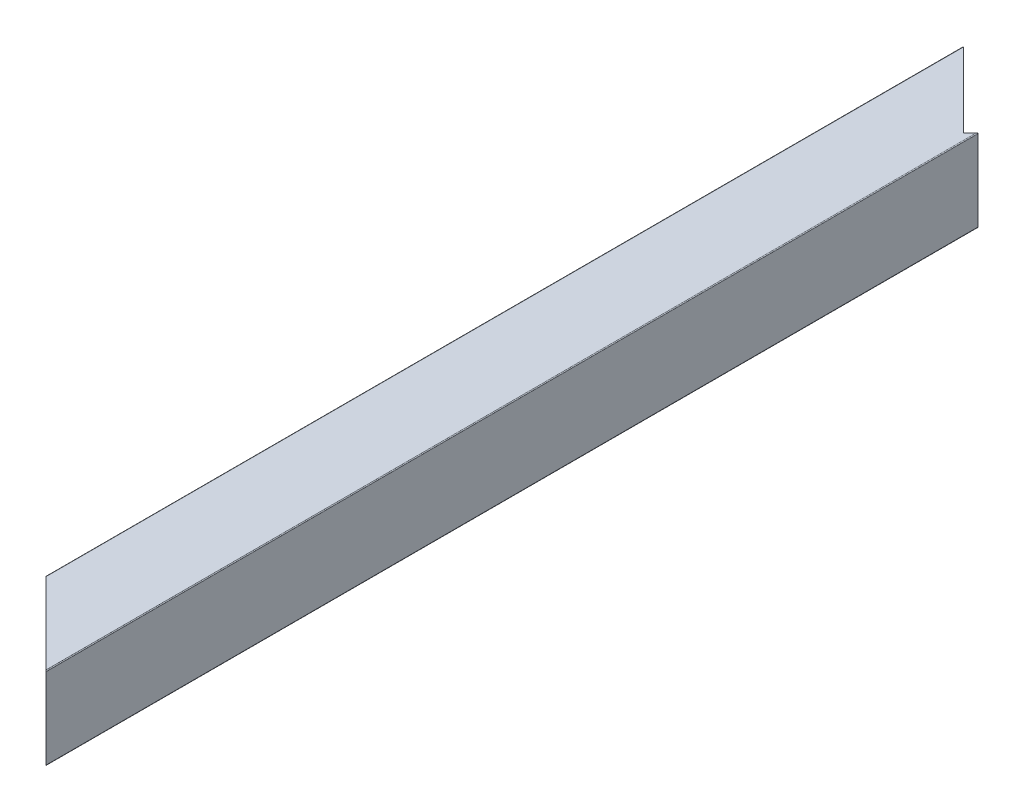
ISO-10303-21;
HEADER;
FILE_DESCRIPTION(('STEP AP214'),'2;1');
FILE_NAME('part.step','',(''),(''),'','','');
FILE_SCHEMA(('AUTOMOTIVE_DESIGN { 1 0 10303 214 1 1 1 1 }'));
ENDSEC;
DATA;
#1=APPLICATION_CONTEXT('core data for automotive mechanical design processes');
#2=APPLICATION_PROTOCOL_DEFINITION('international standard','automotive_design',2000,#1);
#3=PRODUCT_CONTEXT('',#1,'mechanical');
#4=PRODUCT('Part','Part','',(#3));
#5=PRODUCT_RELATED_PRODUCT_CATEGORY('part','',(#4));
#6=PRODUCT_DEFINITION_FORMATION('','',#4);
#7=PRODUCT_DEFINITION_CONTEXT('part definition',#1,'design');
#8=PRODUCT_DEFINITION('design','',#6,#7);
#9=PRODUCT_DEFINITION_SHAPE('','',#8);
#10=(LENGTH_UNIT() NAMED_UNIT(*) SI_UNIT(.MILLI.,.METRE.));
#11=(NAMED_UNIT(*) PLANE_ANGLE_UNIT() SI_UNIT($,.RADIAN.));
#12=(NAMED_UNIT(*) SI_UNIT($,.STERADIAN.) SOLID_ANGLE_UNIT());
#13=UNCERTAINTY_MEASURE_WITH_UNIT(LENGTH_MEASURE(1.E-05),#10,'distance_accuracy_value','');
#14=(GEOMETRIC_REPRESENTATION_CONTEXT(3) GLOBAL_UNCERTAINTY_ASSIGNED_CONTEXT((#13)) GLOBAL_UNIT_ASSIGNED_CONTEXT((#10,
#11,#12)) REPRESENTATION_CONTEXT('',''));
#15=CARTESIAN_POINT('',(0.,0.,0.));
#16=DIRECTION('',(0.,0.,1.));
#17=DIRECTION('',(1.,0.,0.));
#18=AXIS2_PLACEMENT_3D('',#15,#16,#17);
#19=CARTESIAN_POINT('',(3.175,4.7625,1828.8));
#20=DIRECTION('',(1.,0.,0.));
#21=DIRECTION('',(0.,1.,0.));
#22=AXIS2_PLACEMENT_3D('',#19,#20,#21);
#23=PLANE('',#22);
#24=DIRECTION('',(0.,1.,0.));
#25=VECTOR('',#24,1.);
#26=CARTESIAN_POINT('',(3.175,4.7625,1806.575));
#27=LINE('',#26,#25);
#28=CARTESIAN_POINT('',(3.175,4.7625,1806.575));
#29=VERTEX_POINT('',#28);
#30=CARTESIAN_POINT('',(3.175,20.6375,1806.575));
#31=VERTEX_POINT('',#30);
#32=EDGE_CURVE('E340',#29,#31,#27,.T.);
#33=ORIENTED_EDGE('',*,*,#32,.F.);
#34=DIRECTION('',(0.,0.,-1.));
#35=VECTOR('',#34,1.);
#36=CARTESIAN_POINT('',(3.175,4.7625,1828.8));
#37=LINE('',#36,#35);
#38=CARTESIAN_POINT('',(3.175,4.7625,1523.619));
#39=VERTEX_POINT('',#38);
#40=EDGE_CURVE('E69',#29,#39,#37,.T.);
#41=ORIENTED_EDGE('',*,*,#40,.T.);
#42=DIRECTION('',(0.,-1.,0.));
#43=VECTOR('',#42,1.);
#44=CARTESIAN_POINT('',(3.175,4.7625,1523.619));
#45=LINE('',#44,#43);
#46=CARTESIAN_POINT('',(3.175,20.6375,1523.619));
#47=VERTEX_POINT('',#46);
#48=EDGE_CURVE('E289',#47,#39,#45,.T.);
#49=ORIENTED_EDGE('',*,*,#48,.F.);
#50=DIRECTION('',(0.,0.,-1.));
#51=VECTOR('',#50,1.);
#52=CARTESIAN_POINT('',(3.175,20.6375,1828.8));
#53=LINE('',#52,#51);
#54=EDGE_CURVE('E11',#31,#47,#53,.T.);
#55=ORIENTED_EDGE('',*,*,#54,.F.);
#56=EDGE_LOOP('',(#33,#41,#49,#55));
#57=FACE_BOUND('',#56,.T.);
#58=ADVANCED_FACE('F43',(#57),#23,.T.);
#59=CARTESIAN_POINT('',(4.7625,20.6375,1828.8));
#60=DIRECTION('',(0.,0.,-1.));
#61=DIRECTION('',(-1.,0.,0.));
#62=AXIS2_PLACEMENT_3D('',#59,#60,#61);
#63=CYLINDRICAL_SURFACE('',#62,1.5875);
#64=DIRECTION('',(0.,0.,-1.));
#65=VECTOR('',#64,1.);
#66=CARTESIAN_POINT('',(4.7625,22.225,1828.8));
#67=LINE('',#66,#65);
#68=CARTESIAN_POINT('',(4.7625,22.225,1808.1625));
#69=VERTEX_POINT('',#68);
#70=CARTESIAN_POINT('',(4.7625,22.225,1525.2065));
#71=VERTEX_POINT('',#70);
#72=EDGE_CURVE('E53',#69,#71,#67,.T.);
#73=ORIENTED_EDGE('',*,*,#72,.F.);
#74=CARTESIAN_POINT('',(4.7625,20.6375,1808.1625));
#75=DIRECTION('',(0.707106781186545,0.,-0.70710678118655));
#76=DIRECTION('',(-0.70710678118655,0.,-0.707106781186545));
#77=AXIS2_PLACEMENT_3D('',#74,#75,#76);
#78=ELLIPSE('',#77,2.24506403026728,1.5875);
#79=EDGE_CURVE('E333',#69,#31,#78,.F.);
#80=ORIENTED_EDGE('',*,*,#79,.T.);
#81=ORIENTED_EDGE('',*,*,#54,.T.);
#82=CARTESIAN_POINT('',(4.7625,20.6375,1525.2065));
#83=DIRECTION('',(-0.707106781186546,0.,0.707106781186549));
#84=DIRECTION('',(-0.707106781186549,0.,-0.707106781186546));
#85=AXIS2_PLACEMENT_3D('',#82,#83,#84);
#86=ELLIPSE('',#85,2.24506403026728,1.5875);
#87=EDGE_CURVE('E282',#47,#71,#86,.F.);
#88=ORIENTED_EDGE('',*,*,#87,.T.);
#89=EDGE_LOOP('',(#73,#80,#81,#88));
#90=FACE_BOUND('',#89,.T.);
#91=ADVANCED_FACE('F287',(#90),#63,.F.);
#92=CARTESIAN_POINT('',(4.7625,22.225,1828.8));
#93=DIRECTION('',(0.,-1.,0.));
#94=DIRECTION('',(0.,0.,-1.));
#95=AXIS2_PLACEMENT_3D('',#92,#93,#94);
#96=PLANE('',#95);
#97=DIRECTION('',(0.70710678118655,0.,0.707106781186545));
#98=VECTOR('',#97,1.);
#99=CARTESIAN_POINT('',(15.08125,22.225,1818.48125));
#100=LINE('',#99,#98);
#101=CARTESIAN_POINT('',(20.6375,22.225,1824.0375));
#102=VERTEX_POINT('',#101);
#103=EDGE_CURVE('E273',#69,#102,#100,.T.);
#104=ORIENTED_EDGE('',*,*,#103,.F.);
#105=ORIENTED_EDGE('',*,*,#72,.T.);
#106=DIRECTION('',(-0.707106781186549,0.,-0.707106781186546));
#107=VECTOR('',#106,1.);
#108=CARTESIAN_POINT('',(156.55925,22.225,1677.00325));
#109=LINE('',#108,#107);
#110=CARTESIAN_POINT('',(20.6375,22.225,1541.0815));
#111=VERTEX_POINT('',#110);
#112=EDGE_CURVE('E272',#111,#71,#109,.T.);
#113=ORIENTED_EDGE('',*,*,#112,.F.);
#114=DIRECTION('',(0.,0.,-1.));
#115=VECTOR('',#114,1.);
#116=CARTESIAN_POINT('',(20.6375,22.225,1828.8));
#117=LINE('',#116,#115);
#118=EDGE_CURVE('E259',#102,#111,#117,.T.);
#119=ORIENTED_EDGE('',*,*,#118,.F.);
#120=EDGE_LOOP('',(#104,#105,#113,#119));
#121=FACE_BOUND('',#120,.T.);
#122=ADVANCED_FACE('F270',(#121),#96,.T.);
#123=CARTESIAN_POINT('',(20.6375,20.6375,1828.8));
#124=DIRECTION('',(0.,0.,-1.));
#125=DIRECTION('',(-1.,0.,0.));
#126=AXIS2_PLACEMENT_3D('',#123,#124,#125);
#127=CYLINDRICAL_SURFACE('',#126,1.5875);
#128=DIRECTION('',(0.,0.,-1.));
#129=VECTOR('',#128,1.);
#130=CARTESIAN_POINT('',(22.225,20.6375,1828.8));
#131=LINE('',#130,#129);
#132=CARTESIAN_POINT('',(22.225,20.6375,1825.625));
#133=VERTEX_POINT('',#132);
#134=CARTESIAN_POINT('',(22.225,20.6375,1542.669));
#135=VERTEX_POINT('',#134);
#136=EDGE_CURVE('E205',#133,#135,#131,.T.);
#137=ORIENTED_EDGE('',*,*,#136,.F.);
#138=CARTESIAN_POINT('',(20.6375,20.6375,1824.0375));
#139=DIRECTION('',(0.707106781186545,0.,-0.70710678118655));
#140=DIRECTION('',(-0.70710678118655,0.,-0.707106781186545));
#141=AXIS2_PLACEMENT_3D('',#138,#139,#140);
#142=ELLIPSE('',#141,2.24506403026728,1.5875);
#143=EDGE_CURVE('E329',#133,#102,#142,.F.);
#144=ORIENTED_EDGE('',*,*,#143,.T.);
#145=ORIENTED_EDGE('',*,*,#118,.T.);
#146=CARTESIAN_POINT('',(20.6375,20.6375,1541.0815));
#147=DIRECTION('',(-0.707106781186546,0.,0.707106781186549));
#148=DIRECTION('',(-0.707106781186549,0.,-0.707106781186546));
#149=AXIS2_PLACEMENT_3D('',#146,#147,#148);
#150=ELLIPSE('',#149,2.24506403026728,1.5875);
#151=EDGE_CURVE('E285',#111,#135,#150,.F.);
#152=ORIENTED_EDGE('',*,*,#151,.T.);
#153=EDGE_LOOP('',(#137,#144,#145,#152));
#154=FACE_BOUND('',#153,.T.);
#155=ADVANCED_FACE('F327',(#154),#127,.F.);
#156=CARTESIAN_POINT('',(22.225,4.7625,1828.8));
#157=DIRECTION('',(-1.,0.,0.));
#158=DIRECTION('',(0.,0.,1.));
#159=AXIS2_PLACEMENT_3D('',#156,#157,#158);
#160=PLANE('',#159);
#161=DIRECTION('',(0.,-1.,0.));
#162=VECTOR('',#161,1.);
#163=CARTESIAN_POINT('',(22.225,4.7625,1825.625));
#164=LINE('',#163,#162);
#165=CARTESIAN_POINT('',(22.225,4.7625,1825.625));
#166=VERTEX_POINT('',#165);
#167=EDGE_CURVE('E331',#133,#166,#164,.T.);
#168=ORIENTED_EDGE('',*,*,#167,.F.);
#169=ORIENTED_EDGE('',*,*,#136,.T.);
#170=DIRECTION('',(0.,1.,0.));
#171=VECTOR('',#170,1.);
#172=CARTESIAN_POINT('',(22.225,4.7625,1542.669));
#173=LINE('',#172,#171);
#174=CARTESIAN_POINT('',(22.225,4.7625,1542.669));
#175=VERTEX_POINT('',#174);
#176=EDGE_CURVE('E324',#175,#135,#173,.T.);
#177=ORIENTED_EDGE('',*,*,#176,.F.);
#178=DIRECTION('',(0.,0.,-1.));
#179=VECTOR('',#178,1.);
#180=CARTESIAN_POINT('',(22.225,4.7625,1828.8));
#181=LINE('',#180,#179);
#182=EDGE_CURVE('E216',#166,#175,#181,.T.);
#183=ORIENTED_EDGE('',*,*,#182,.F.);
#184=EDGE_LOOP('',(#168,#169,#177,#183));
#185=FACE_BOUND('',#184,.T.);
#186=ADVANCED_FACE('F391',(#185),#160,.T.);
#187=CARTESIAN_POINT('',(20.6375,4.7625,1828.8));
#188=DIRECTION('',(0.,0.,-1.));
#189=DIRECTION('',(-1.,0.,0.));
#190=AXIS2_PLACEMENT_3D('',#187,#188,#189);
#191=CYLINDRICAL_SURFACE('',#190,1.5875);
#192=DIRECTION('',(0.,0.,-1.));
#193=VECTOR('',#192,1.);
#194=CARTESIAN_POINT('',(20.6375,3.175,1828.8));
#195=LINE('',#194,#193);
#196=CARTESIAN_POINT('',(20.6375,3.175,1824.0375));
#197=VERTEX_POINT('',#196);
#198=CARTESIAN_POINT('',(20.6375,3.175,1541.0815));
#199=VERTEX_POINT('',#198);
#200=EDGE_CURVE('E214',#197,#199,#195,.T.);
#201=ORIENTED_EDGE('',*,*,#200,.F.);
#202=CARTESIAN_POINT('',(20.6375,4.7625,1824.0375));
#203=DIRECTION('',(0.707106781186545,0.,-0.70710678118655));
#204=DIRECTION('',(-0.70710678118655,0.,-0.707106781186545));
#205=AXIS2_PLACEMENT_3D('',#202,#203,#204);
#206=ELLIPSE('',#205,2.24506403026728,1.5875);
#207=EDGE_CURVE('E335',#197,#166,#206,.F.);
#208=ORIENTED_EDGE('',*,*,#207,.T.);
#209=ORIENTED_EDGE('',*,*,#182,.T.);
#210=CARTESIAN_POINT('',(20.6375,4.7625,1541.0815));
#211=DIRECTION('',(-0.707106781186546,0.,0.707106781186549));
#212=DIRECTION('',(-0.707106781186549,0.,-0.707106781186546));
#213=AXIS2_PLACEMENT_3D('',#210,#211,#212);
#214=ELLIPSE('',#213,2.24506403026728,1.5875);
#215=EDGE_CURVE('E321',#175,#199,#214,.F.);
#216=ORIENTED_EDGE('',*,*,#215,.T.);
#217=EDGE_LOOP('',(#201,#208,#209,#216));
#218=FACE_BOUND('',#217,.T.);
#219=ADVANCED_FACE('F388',(#218),#191,.F.);
#220=CARTESIAN_POINT('',(4.7625,3.175,1828.8));
#221=DIRECTION('',(0.,1.,0.));
#222=DIRECTION('',(1.,0.,0.));
#223=AXIS2_PLACEMENT_3D('',#220,#221,#222);
#224=PLANE('',#223);
#225=DIRECTION('',(-0.70710678118655,0.,-0.707106781186545));
#226=VECTOR('',#225,1.);
#227=CARTESIAN_POINT('',(15.08125,3.175,1818.48125));
#228=LINE('',#227,#226);
#229=CARTESIAN_POINT('',(4.7625,3.175,1808.1625));
#230=VERTEX_POINT('',#229);
#231=EDGE_CURVE('E61',#197,#230,#228,.T.);
#232=ORIENTED_EDGE('',*,*,#231,.F.);
#233=ORIENTED_EDGE('',*,*,#200,.T.);
#234=DIRECTION('',(0.707106781186549,0.,0.707106781186546));
#235=VECTOR('',#234,1.);
#236=CARTESIAN_POINT('',(156.55925,3.175,1677.00325));
#237=LINE('',#236,#235);
#238=CARTESIAN_POINT('',(4.7625,3.175,1525.2065));
#239=VERTEX_POINT('',#238);
#240=EDGE_CURVE('E314',#239,#199,#237,.T.);
#241=ORIENTED_EDGE('',*,*,#240,.F.);
#242=DIRECTION('',(0.,0.,-1.));
#243=VECTOR('',#242,1.);
#244=CARTESIAN_POINT('',(4.7625,3.175,1828.8));
#245=LINE('',#244,#243);
#246=EDGE_CURVE('E217',#230,#239,#245,.T.);
#247=ORIENTED_EDGE('',*,*,#246,.F.);
#248=EDGE_LOOP('',(#232,#233,#241,#247));
#249=FACE_BOUND('',#248,.T.);
#250=ADVANCED_FACE('F390',(#249),#224,.T.);
#251=CARTESIAN_POINT('',(4.7625,4.7625,1828.8));
#252=DIRECTION('',(0.,0.,-1.));
#253=DIRECTION('',(-1.,0.,0.));
#254=AXIS2_PLACEMENT_3D('',#251,#252,#253);
#255=CYLINDRICAL_SURFACE('',#254,1.5875);
#256=ORIENTED_EDGE('',*,*,#40,.F.);
#257=CARTESIAN_POINT('',(4.7625,4.7625,1808.1625));
#258=DIRECTION('',(0.707106781186545,0.,-0.70710678118655));
#259=DIRECTION('',(-0.70710678118655,0.,-0.707106781186545));
#260=AXIS2_PLACEMENT_3D('',#257,#258,#259);
#261=ELLIPSE('',#260,2.24506403026728,1.5875);
#262=EDGE_CURVE('E633',#29,#230,#261,.F.);
#263=ORIENTED_EDGE('',*,*,#262,.T.);
#264=ORIENTED_EDGE('',*,*,#246,.T.);
#265=CARTESIAN_POINT('',(4.7625,4.7625,1525.2065));
#266=DIRECTION('',(-0.707106781186546,0.,0.707106781186549));
#267=DIRECTION('',(-0.707106781186549,0.,-0.707106781186546));
#268=AXIS2_PLACEMENT_3D('',#265,#266,#267);
#269=ELLIPSE('',#268,2.24506403026728,1.5875);
#270=EDGE_CURVE('E312',#239,#39,#269,.F.);
#271=ORIENTED_EDGE('',*,*,#270,.T.);
#272=EDGE_LOOP('',(#256,#263,#264,#271));
#273=FACE_BOUND('',#272,.T.);
#274=ADVANCED_FACE('F397',(#273),#255,.F.);
#275=CARTESIAN_POINT('',(0.,0.254,1828.8));
#276=DIRECTION('',(1.,0.,0.));
#277=DIRECTION('',(0.,1.,0.));
#278=AXIS2_PLACEMENT_3D('',#275,#276,#277);
#279=PLANE('',#278);
#280=DIRECTION('',(0.,0.,-1.));
#281=VECTOR('',#280,1.);
#282=CARTESIAN_POINT('',(0.,0.254,1828.8));
#283=LINE('',#282,#281);
#284=CARTESIAN_POINT('',(0.,0.254,1803.4));
#285=VERTEX_POINT('',#284);
#286=CARTESIAN_POINT('',(0.,0.254,1520.444));
#287=VERTEX_POINT('',#286);
#288=EDGE_CURVE('E194',#285,#287,#283,.T.);
#289=ORIENTED_EDGE('',*,*,#288,.F.);
#290=DIRECTION('',(0.,1.,0.));
#291=VECTOR('',#290,1.);
#292=CARTESIAN_POINT('',(0.,0.254,1803.4));
#293=LINE('',#292,#291);
#294=CARTESIAN_POINT('',(0.,25.146,1803.4));
#295=VERTEX_POINT('',#294);
#296=EDGE_CURVE('E173',#285,#295,#293,.T.);
#297=ORIENTED_EDGE('',*,*,#296,.T.);
#298=DIRECTION('',(0.,0.,-1.));
#299=VECTOR('',#298,1.);
#300=CARTESIAN_POINT('',(0.,25.146,1828.8));
#301=LINE('',#300,#299);
#302=CARTESIAN_POINT('',(0.,25.1460000000001,1520.444));
#303=VERTEX_POINT('',#302);
#304=EDGE_CURVE('E213',#295,#303,#301,.T.);
#305=ORIENTED_EDGE('',*,*,#304,.T.);
#306=DIRECTION('',(0.,-1.,0.));
#307=VECTOR('',#306,1.);
#308=CARTESIAN_POINT('',(0.,0.254,1520.444));
#309=LINE('',#308,#307);
#310=EDGE_CURVE('E202',#303,#287,#309,.T.);
#311=ORIENTED_EDGE('',*,*,#310,.T.);
#312=EDGE_LOOP('',(#289,#297,#305,#311));
#313=FACE_BOUND('',#312,.T.);
#314=ADVANCED_FACE('F302',(#313),#279,.F.);
#315=CARTESIAN_POINT('',(0.254,25.146,1828.8));
#316=DIRECTION('',(0.,0.,-1.));
#317=DIRECTION('',(-1.,0.,0.));
#318=AXIS2_PLACEMENT_3D('',#315,#316,#317);
#319=CYLINDRICAL_SURFACE('',#318,0.254);
#320=CARTESIAN_POINT('',(0.254,25.146,1803.654));
#321=DIRECTION('',(0.707106781186545,0.,-0.70710678118655));
#322=DIRECTION('',(-0.70710678118655,0.,-0.707106781186545));
#323=AXIS2_PLACEMENT_3D('',#320,#321,#322);
#324=ELLIPSE('',#323,0.359210244842765,0.254);
#325=CARTESIAN_POINT('',(0.253999999999983,25.4,1803.654));
#326=VERTEX_POINT('',#325);
#327=EDGE_CURVE('E638',#326,#295,#324,.F.);
#328=ORIENTED_EDGE('',*,*,#327,.F.);
#329=DIRECTION('',(0.,0.,-1.));
#330=VECTOR('',#329,1.);
#331=CARTESIAN_POINT('',(0.254,25.4,1828.8));
#332=LINE('',#331,#330);
#333=CARTESIAN_POINT('',(0.253999999999994,25.4,1520.698));
#334=VERTEX_POINT('',#333);
#335=EDGE_CURVE('E210',#326,#334,#332,.T.);
#336=ORIENTED_EDGE('',*,*,#335,.T.);
#337=CARTESIAN_POINT('',(0.254,25.146,1520.698));
#338=DIRECTION('',(-0.707106781186546,0.,0.707106781186549));
#339=DIRECTION('',(-0.707106781186549,0.,-0.707106781186546));
#340=AXIS2_PLACEMENT_3D('',#337,#338,#339);
#341=ELLIPSE('',#340,0.359210244842765,0.254);
#342=EDGE_CURVE('E306',#303,#334,#341,.F.);
#343=ORIENTED_EDGE('',*,*,#342,.F.);
#344=ORIENTED_EDGE('',*,*,#304,.F.);
#345=EDGE_LOOP('',(#328,#336,#343,#344));
#346=FACE_BOUND('',#345,.T.);
#347=ADVANCED_FACE('F310',(#346),#319,.T.);
#348=CARTESIAN_POINT('',(0.254,25.4,1828.8));
#349=DIRECTION('',(0.,-1.,0.));
#350=DIRECTION('',(0.,0.,-1.));
#351=AXIS2_PLACEMENT_3D('',#348,#349,#350);
#352=PLANE('',#351);
#353=ORIENTED_EDGE('',*,*,#335,.F.);
#354=DIRECTION('',(-0.70710678118655,0.,-0.707106781186545));
#355=VECTOR('',#354,1.);
#356=CARTESIAN_POINT('',(34.1927663058368,25.4,1837.59276630584));
#357=LINE('',#356,#355);
#358=CARTESIAN_POINT('',(25.146,25.4,1828.546));
#359=VERTEX_POINT('',#358);
#360=EDGE_CURVE('E187',#359,#326,#357,.T.);
#361=ORIENTED_EDGE('',*,*,#360,.F.);
#362=DIRECTION('',(0.,0.,-1.));
#363=VECTOR('',#362,1.);
#364=CARTESIAN_POINT('',(25.146,25.4,1828.8));
#365=LINE('',#364,#363);
#366=CARTESIAN_POINT('',(25.146,25.4,1541.6517358999));
#367=VERTEX_POINT('',#366);
#368=EDGE_CURVE('E207',#359,#367,#365,.T.);
#369=ORIENTED_EDGE('',*,*,#368,.T.);
#370=DIRECTION('',(0.707106781186548,0.,-0.707106781186547));
#371=VECTOR('',#370,1.);
#372=CARTESIAN_POINT('',(41.1373801920875,25.4,1525.66035570781));
#373=LINE('',#372,#371);
#374=CARTESIAN_POINT('',(23.1768679499492,25.4,1543.62086794995));
#375=VERTEX_POINT('',#374);
#376=EDGE_CURVE('E348',#375,#367,#373,.T.);
#377=ORIENTED_EDGE('',*,*,#376,.F.);
#378=DIRECTION('',(0.707106781186549,0.,0.707106781186546));
#379=VECTOR('',#378,1.);
#380=CARTESIAN_POINT('',(23.1768679499492,25.4,1543.62086794995));
#381=LINE('',#380,#379);
#382=EDGE_CURVE('E342',#334,#375,#381,.T.);
#383=ORIENTED_EDGE('',*,*,#382,.F.);
#384=EDGE_LOOP('',(#353,#361,#369,#377,#383));
#385=FACE_BOUND('',#384,.T.);
#386=ADVANCED_FACE('F357',(#385),#352,.F.);
#387=CARTESIAN_POINT('',(25.146,25.146,1828.8));
#388=DIRECTION('',(0.,0.,-1.));
#389=DIRECTION('',(-1.,0.,0.));
#390=AXIS2_PLACEMENT_3D('',#387,#388,#389);
#391=CYLINDRICAL_SURFACE('',#390,0.254);
#392=CARTESIAN_POINT('',(25.146,25.146,1828.546));
#393=DIRECTION('',(0.707106781186545,0.,-0.70710678118655));
#394=DIRECTION('',(-0.70710678118655,0.,-0.707106781186545));
#395=AXIS2_PLACEMENT_3D('',#392,#393,#394);
#396=ELLIPSE('',#395,0.359210244842765,0.254);
#397=CARTESIAN_POINT('',(25.4000000000002,25.146,1828.8));
#398=VERTEX_POINT('',#397);
#399=EDGE_CURVE('E362',#398,#359,#396,.F.);
#400=ORIENTED_EDGE('',*,*,#399,.F.);
#401=DIRECTION('',(0.,0.,-1.));
#402=VECTOR('',#401,1.);
#403=CARTESIAN_POINT('',(25.4,25.146,1828.8));
#404=LINE('',#403,#402);
#405=CARTESIAN_POINT('',(25.4,25.146,1541.3977358999));
#406=VERTEX_POINT('',#405);
#407=EDGE_CURVE('E211',#398,#406,#404,.T.);
#408=ORIENTED_EDGE('',*,*,#407,.T.);
#409=CARTESIAN_POINT('',(25.146,25.146,1541.6517358999));
#410=DIRECTION('',(0.707106781186547,0.,0.707106781186548));
#411=DIRECTION('',(0.707106781186548,0.,-0.707106781186547));
#412=AXIS2_PLACEMENT_3D('',#409,#410,#411);
#413=ELLIPSE('',#412,0.359210244842766,0.254);
#414=EDGE_CURVE('E298',#367,#406,#413,.F.);
#415=ORIENTED_EDGE('',*,*,#414,.F.);
#416=ORIENTED_EDGE('',*,*,#368,.F.);
#417=EDGE_LOOP('',(#400,#408,#415,#416));
#418=FACE_BOUND('',#417,.T.);
#419=ADVANCED_FACE('F45',(#418),#391,.T.);
#420=CARTESIAN_POINT('',(25.4,0.254,1828.8));
#421=DIRECTION('',(-1.,0.,0.));
#422=DIRECTION('',(0.,0.,1.));
#423=AXIS2_PLACEMENT_3D('',#420,#421,#422);
#424=PLANE('',#423);
#425=DIRECTION('',(0.,0.,-1.));
#426=VECTOR('',#425,1.);
#427=CARTESIAN_POINT('',(25.4,0.254,1828.8));
#428=LINE('',#427,#426);
#429=CARTESIAN_POINT('',(25.4,0.254,1828.8));
#430=VERTEX_POINT('',#429);
#431=CARTESIAN_POINT('',(25.4,0.254,1541.3977358999));
#432=VERTEX_POINT('',#431);
#433=EDGE_CURVE('E240',#430,#432,#428,.T.);
#434=ORIENTED_EDGE('',*,*,#433,.T.);
#435=DIRECTION('',(0.,1.,0.));
#436=VECTOR('',#435,1.);
#437=CARTESIAN_POINT('',(25.4,0.254,1541.3977358999));
#438=LINE('',#437,#436);
#439=EDGE_CURVE('E296',#432,#406,#438,.T.);
#440=ORIENTED_EDGE('',*,*,#439,.T.);
#441=ORIENTED_EDGE('',*,*,#407,.F.);
#442=DIRECTION('',(0.,1.,0.));
#443=VECTOR('',#442,1.);
#444=CARTESIAN_POINT('',(25.4,0.254,1828.8));
#445=LINE('',#444,#443);
#446=EDGE_CURVE('E47',#430,#398,#445,.T.);
#447=ORIENTED_EDGE('',*,*,#446,.F.);
#448=EDGE_LOOP('',(#434,#440,#441,#447));
#449=FACE_BOUND('',#448,.T.);
#450=ADVANCED_FACE('F364',(#449),#424,.F.);
#451=CARTESIAN_POINT('',(25.146,0.254,1828.8));
#452=DIRECTION('',(0.,0.,-1.));
#453=DIRECTION('',(-1.,0.,0.));
#454=AXIS2_PLACEMENT_3D('',#451,#452,#453);
#455=CYLINDRICAL_SURFACE('',#454,0.254);
#456=CARTESIAN_POINT('',(25.146,0.254,1828.546));
#457=DIRECTION('',(0.707106781186545,0.,-0.70710678118655));
#458=DIRECTION('',(-0.70710678118655,0.,-0.707106781186545));
#459=AXIS2_PLACEMENT_3D('',#456,#457,#458);
#460=ELLIPSE('',#459,0.359210244842765,0.254);
#461=CARTESIAN_POINT('',(25.146,0.,1828.546));
#462=VERTEX_POINT('',#461);
#463=EDGE_CURVE('E177',#462,#430,#460,.F.);
#464=ORIENTED_EDGE('',*,*,#463,.F.);
#465=DIRECTION('',(0.,0.,-1.));
#466=VECTOR('',#465,1.);
#467=CARTESIAN_POINT('',(25.146,0.,1828.8));
#468=LINE('',#467,#466);
#469=CARTESIAN_POINT('',(25.146,0.,1541.6517358999));
#470=VERTEX_POINT('',#469);
#471=EDGE_CURVE('E186',#462,#470,#468,.T.);
#472=ORIENTED_EDGE('',*,*,#471,.T.);
#473=CARTESIAN_POINT('',(25.146,0.254,1541.6517358999));
#474=DIRECTION('',(0.707106781186547,0.,0.707106781186548));
#475=DIRECTION('',(0.707106781186548,0.,-0.707106781186547));
#476=AXIS2_PLACEMENT_3D('',#473,#474,#475);
#477=ELLIPSE('',#476,0.359210244842766,0.254);
#478=EDGE_CURVE('E291',#432,#470,#477,.F.);
#479=ORIENTED_EDGE('',*,*,#478,.F.);
#480=ORIENTED_EDGE('',*,*,#433,.F.);
#481=EDGE_LOOP('',(#464,#472,#479,#480));
#482=FACE_BOUND('',#481,.T.);
#483=ADVANCED_FACE('F366',(#482),#455,.T.);
#484=CARTESIAN_POINT('',(0.254,0.,1828.8));
#485=DIRECTION('',(0.,1.,0.));
#486=DIRECTION('',(1.,0.,0.));
#487=AXIS2_PLACEMENT_3D('',#484,#485,#486);
#488=PLANE('',#487);
#489=ORIENTED_EDGE('',*,*,#471,.F.);
#490=DIRECTION('',(0.70710678118655,0.,0.707106781186545));
#491=VECTOR('',#490,1.);
#492=CARTESIAN_POINT('',(34.1927663058368,0.,1837.59276630584));
#493=LINE('',#492,#491);
#494=CARTESIAN_POINT('',(0.253999999999999,0.,1803.654));
#495=VERTEX_POINT('',#494);
#496=EDGE_CURVE('E170',#495,#462,#493,.T.);
#497=ORIENTED_EDGE('',*,*,#496,.F.);
#498=DIRECTION('',(0.,0.,-1.));
#499=VECTOR('',#498,1.);
#500=CARTESIAN_POINT('',(0.254,0.,1828.8));
#501=LINE('',#500,#499);
#502=CARTESIAN_POINT('',(0.254,0.,1520.698));
#503=VERTEX_POINT('',#502);
#504=EDGE_CURVE('E183',#495,#503,#501,.T.);
#505=ORIENTED_EDGE('',*,*,#504,.T.);
#506=DIRECTION('',(-0.707106781186549,0.,-0.707106781186546));
#507=VECTOR('',#506,1.);
#508=CARTESIAN_POINT('',(23.1768679499492,0.,1543.62086794995));
#509=LINE('',#508,#507);
#510=CARTESIAN_POINT('',(23.1768679499492,0.,1543.62086794995));
#511=VERTEX_POINT('',#510);
#512=EDGE_CURVE('E343',#511,#503,#509,.T.);
#513=ORIENTED_EDGE('',*,*,#512,.F.);
#514=DIRECTION('',(-0.707106781186548,0.,0.707106781186547));
#515=VECTOR('',#514,1.);
#516=CARTESIAN_POINT('',(41.1373801920875,0.,1525.66035570781));
#517=LINE('',#516,#515);
#518=EDGE_CURVE('E316',#470,#511,#517,.T.);
#519=ORIENTED_EDGE('',*,*,#518,.F.);
#520=EDGE_LOOP('',(#489,#497,#505,#513,#519));
#521=FACE_BOUND('',#520,.T.);
#522=ADVANCED_FACE('F181',(#521),#488,.F.);
#523=CARTESIAN_POINT('',(0.254,0.254,1828.8));
#524=DIRECTION('',(0.,0.,-1.));
#525=DIRECTION('',(-1.,0.,0.));
#526=AXIS2_PLACEMENT_3D('',#523,#524,#525);
#527=CYLINDRICAL_SURFACE('',#526,0.254);
#528=CARTESIAN_POINT('',(0.254,0.254,1803.654));
#529=DIRECTION('',(0.707106781186545,0.,-0.70710678118655));
#530=DIRECTION('',(-0.70710678118655,0.,-0.707106781186545));
#531=AXIS2_PLACEMENT_3D('',#528,#529,#530);
#532=ELLIPSE('',#531,0.359210244842765,0.254);
#533=EDGE_CURVE('E167',#285,#495,#532,.F.);
#534=ORIENTED_EDGE('',*,*,#533,.F.);
#535=ORIENTED_EDGE('',*,*,#288,.T.);
#536=CARTESIAN_POINT('',(0.254,0.254,1520.698));
#537=DIRECTION('',(-0.707106781186546,0.,0.707106781186549));
#538=DIRECTION('',(-0.707106781186549,0.,-0.707106781186546));
#539=AXIS2_PLACEMENT_3D('',#536,#537,#538);
#540=ELLIPSE('',#539,0.359210244842765,0.254);
#541=EDGE_CURVE('E192',#503,#287,#540,.F.);
#542=ORIENTED_EDGE('',*,*,#541,.F.);
#543=ORIENTED_EDGE('',*,*,#504,.F.);
#544=EDGE_LOOP('',(#534,#535,#542,#543));
#545=FACE_BOUND('',#544,.T.);
#546=ADVANCED_FACE('F190',(#545),#527,.T.);
#547=CARTESIAN_POINT('',(41.1373801920875,-76.2,1525.66035570781));
#548=DIRECTION('',(0.707106781186547,0.,0.707106781186548));
#549=DIRECTION('',(0.707106781186548,0.,-0.707106781186547));
#550=AXIS2_PLACEMENT_3D('',#547,#548,#549);
#551=PLANE('',#550);
#552=ORIENTED_EDGE('',*,*,#414,.T.);
#553=ORIENTED_EDGE('',*,*,#439,.F.);
#554=ORIENTED_EDGE('',*,*,#478,.T.);
#555=ORIENTED_EDGE('',*,*,#518,.T.);
#556=DIRECTION('',(0.,1.,0.));
#557=VECTOR('',#556,1.);
#558=CARTESIAN_POINT('',(23.1768679499492,-76.2,1543.62086794995));
#559=LINE('',#558,#557);
#560=EDGE_CURVE('E345',#511,#375,#559,.T.);
#561=ORIENTED_EDGE('',*,*,#560,.T.);
#562=ORIENTED_EDGE('',*,*,#376,.T.);
#563=EDGE_LOOP('',(#552,#553,#554,#555,#561,#562));
#564=FACE_BOUND('',#563,.T.);
#565=ADVANCED_FACE('F354',(#564),#551,.F.);
#566=CARTESIAN_POINT('',(23.1768679499492,-76.2,1543.62086794995));
#567=DIRECTION('',(-0.707106781186546,0.,0.707106781186549));
#568=DIRECTION('',(0.707106781186549,0.,0.707106781186546));
#569=AXIS2_PLACEMENT_3D('',#566,#567,#568);
#570=PLANE('',#569);
#571=ORIENTED_EDGE('',*,*,#48,.T.);
#572=ORIENTED_EDGE('',*,*,#270,.F.);
#573=ORIENTED_EDGE('',*,*,#240,.T.);
#574=ORIENTED_EDGE('',*,*,#215,.F.);
#575=ORIENTED_EDGE('',*,*,#176,.T.);
#576=ORIENTED_EDGE('',*,*,#151,.F.);
#577=ORIENTED_EDGE('',*,*,#112,.T.);
#578=ORIENTED_EDGE('',*,*,#87,.F.);
#579=EDGE_LOOP('',(#571,#572,#573,#574,#575,#576,#577,#578));
#580=FACE_BOUND('',#579,.T.);
#581=ORIENTED_EDGE('',*,*,#342,.T.);
#582=ORIENTED_EDGE('',*,*,#382,.T.);
#583=ORIENTED_EDGE('',*,*,#560,.F.);
#584=ORIENTED_EDGE('',*,*,#512,.T.);
#585=ORIENTED_EDGE('',*,*,#541,.T.);
#586=ORIENTED_EDGE('',*,*,#310,.F.);
#587=EDGE_LOOP('',(#581,#582,#583,#584,#585,#586));
#588=FACE_BOUND('',#587,.T.);
#589=ADVANCED_FACE('F280',(#580,#588),#570,.F.);
#590=CARTESIAN_POINT('',(34.1927663058368,-76.1999999999998,1837.59276630584));
#591=DIRECTION('',(0.707106781186545,0.,-0.70710678118655));
#592=DIRECTION('',(-0.70710678118655,0.,-0.707106781186545));
#593=AXIS2_PLACEMENT_3D('',#590,#591,#592);
#594=PLANE('',#593);
#595=ORIENTED_EDGE('',*,*,#32,.T.);
#596=ORIENTED_EDGE('',*,*,#79,.F.);
#597=ORIENTED_EDGE('',*,*,#103,.T.);
#598=ORIENTED_EDGE('',*,*,#143,.F.);
#599=ORIENTED_EDGE('',*,*,#167,.T.);
#600=ORIENTED_EDGE('',*,*,#207,.F.);
#601=ORIENTED_EDGE('',*,*,#231,.T.);
#602=ORIENTED_EDGE('',*,*,#262,.F.);
#603=EDGE_LOOP('',(#595,#596,#597,#598,#599,#600,#601,#602));
#604=FACE_BOUND('',#603,.T.);
#605=ORIENTED_EDGE('',*,*,#399,.T.);
#606=ORIENTED_EDGE('',*,*,#360,.T.);
#607=ORIENTED_EDGE('',*,*,#327,.T.);
#608=ORIENTED_EDGE('',*,*,#296,.F.);
#609=ORIENTED_EDGE('',*,*,#533,.T.);
#610=ORIENTED_EDGE('',*,*,#496,.T.);
#611=ORIENTED_EDGE('',*,*,#463,.T.);
#612=ORIENTED_EDGE('',*,*,#446,.T.);
#613=EDGE_LOOP('',(#605,#606,#607,#608,#609,#610,#611,#612));
#614=FACE_BOUND('',#613,.T.);
#615=ADVANCED_FACE('F169',(#604,#614),#594,.F.);
#616=CLOSED_SHELL('',(#58,#91,#122,#155,#186,#219,#250,#274,#314,#347,#386,#419,#450,#483,#522,
#546,#565,#589,#615));
#617=MANIFOLD_SOLID_BREP('B2',#616);
#618=ADVANCED_BREP_SHAPE_REPRESENTATION('',(#18,#617),#14);
#619=SHAPE_DEFINITION_REPRESENTATION(#9,#618);
ENDSEC;
END-ISO-10303-21;
